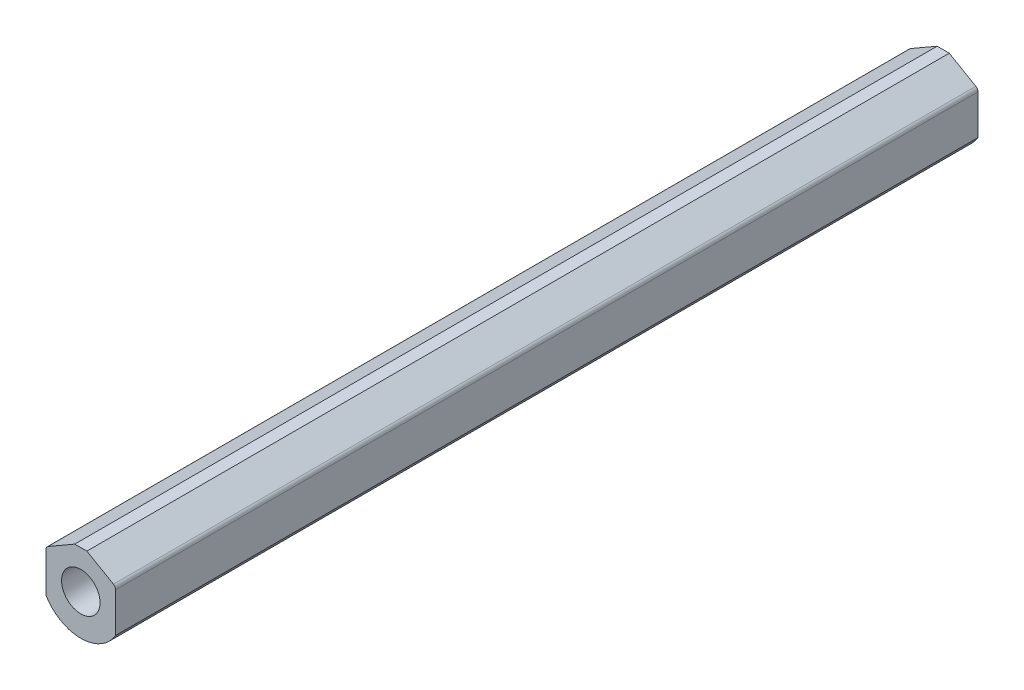
ISO-10303-21;
HEADER;
FILE_DESCRIPTION(('STEP AP214'),'2;1');
FILE_NAME('part.step','',(''),(''),'','','');
FILE_SCHEMA(('AUTOMOTIVE_DESIGN { 1 0 10303 214 1 1 1 1 }'));
ENDSEC;
DATA;
#1=APPLICATION_CONTEXT('core data for automotive mechanical design processes');
#2=APPLICATION_PROTOCOL_DEFINITION('international standard','automotive_design',2000,#1);
#3=PRODUCT_CONTEXT('',#1,'mechanical');
#4=PRODUCT('Part','Part','',(#3));
#5=PRODUCT_RELATED_PRODUCT_CATEGORY('part','',(#4));
#6=PRODUCT_DEFINITION_FORMATION('','',#4);
#7=PRODUCT_DEFINITION_CONTEXT('part definition',#1,'design');
#8=PRODUCT_DEFINITION('design','',#6,#7);
#9=PRODUCT_DEFINITION_SHAPE('','',#8);
#10=(LENGTH_UNIT() NAMED_UNIT(*) SI_UNIT(.MILLI.,.METRE.));
#11=(NAMED_UNIT(*) PLANE_ANGLE_UNIT() SI_UNIT($,.RADIAN.));
#12=(NAMED_UNIT(*) SI_UNIT($,.STERADIAN.) SOLID_ANGLE_UNIT());
#13=UNCERTAINTY_MEASURE_WITH_UNIT(LENGTH_MEASURE(1.E-05),#10,'distance_accuracy_value','');
#14=(GEOMETRIC_REPRESENTATION_CONTEXT(3) GLOBAL_UNCERTAINTY_ASSIGNED_CONTEXT((#13)) GLOBAL_UNIT_ASSIGNED_CONTEXT((#10,
#11,#12)) REPRESENTATION_CONTEXT('',''));
#15=CARTESIAN_POINT('',(0.,0.,0.));
#16=DIRECTION('',(0.,0.,1.));
#17=DIRECTION('',(1.,0.,0.));
#18=AXIS2_PLACEMENT_3D('',#15,#16,#17);
#19=CARTESIAN_POINT('',(-21.5519,13.4874,-609.6));
#20=DIRECTION('',(0.,0.,1.));
#21=DIRECTION('',(1.,0.,0.));
#22=AXIS2_PLACEMENT_3D('',#19,#20,#21);
#23=CYLINDRICAL_SURFACE('',#22,3.048);
#24=CARTESIAN_POINT('',(-21.5519,13.4874,0.));
#25=DIRECTION('',(0.,0.,1.));
#26=DIRECTION('',(1.,0.,0.));
#27=AXIS2_PLACEMENT_3D('',#24,#25,#26);
#28=CIRCLE('',#27,3.048);
#29=CARTESIAN_POINT('',(-23.0759,16.127045430735,0.));
#30=VERTEX_POINT('',#29);
#31=CARTESIAN_POINT('',(-24.5999,13.4874,0.));
#32=VERTEX_POINT('',#31);
#33=EDGE_CURVE('E130',#30,#32,#28,.T.);
#34=ORIENTED_EDGE('',*,*,#33,.F.);
#35=DIRECTION('',(0.,0.,1.));
#36=VECTOR('',#35,1.);
#37=CARTESIAN_POINT('',(-23.0759,16.127045430735,-609.6));
#38=LINE('',#37,#36);
#39=CARTESIAN_POINT('',(-23.0759,16.127045430735,-609.6));
#40=VERTEX_POINT('',#39);
#41=EDGE_CURVE('E11',#40,#30,#38,.T.);
#42=ORIENTED_EDGE('',*,*,#41,.F.);
#43=CARTESIAN_POINT('',(-21.5519,13.4874,-609.6));
#44=DIRECTION('',(0.,0.,1.));
#45=DIRECTION('',(1.,0.,0.));
#46=AXIS2_PLACEMENT_3D('',#43,#44,#45);
#47=CIRCLE('',#46,3.048);
#48=CARTESIAN_POINT('',(-24.5999,13.4874,-609.6));
#49=VERTEX_POINT('',#48);
#50=EDGE_CURVE('E151',#40,#49,#47,.T.);
#51=ORIENTED_EDGE('',*,*,#50,.T.);
#52=DIRECTION('',(0.,0.,1.));
#53=VECTOR('',#52,1.);
#54=CARTESIAN_POINT('',(-24.5999,13.4874,-609.6));
#55=LINE('',#54,#53);
#56=EDGE_CURVE('E36',#49,#32,#55,.T.);
#57=ORIENTED_EDGE('',*,*,#56,.T.);
#58=EDGE_LOOP('',(#34,#42,#51,#57));
#59=FACE_BOUND('',#58,.T.);
#60=ADVANCED_FACE('F33',(#59),#23,.T.);
#61=CARTESIAN_POINT('',(-4.28703793799527,26.9748,-609.6));
#62=DIRECTION('',(-0.499999999999995,0.866025403784442,0.));
#63=DIRECTION('',(-0.866025403784442,-0.499999999999995,0.));
#64=AXIS2_PLACEMENT_3D('',#61,#62,#63);
#65=PLANE('',#64);
#66=DIRECTION('',(-0.866025403784442,-0.499999999999995,0.));
#67=VECTOR('',#66,1.);
#68=CARTESIAN_POINT('',(-4.28703793799527,26.9748,0.));
#69=LINE('',#68,#67);
#70=CARTESIAN_POINT('',(-4.28703793799527,26.9748,0.));
#71=VERTEX_POINT('',#70);
#72=EDGE_CURVE('E149',#71,#30,#69,.T.);
#73=ORIENTED_EDGE('',*,*,#72,.F.);
#74=DIRECTION('',(0.,0.,1.));
#75=VECTOR('',#74,1.);
#76=CARTESIAN_POINT('',(-4.28703793799527,26.9748,-609.6));
#77=LINE('',#76,#75);
#78=CARTESIAN_POINT('',(-4.28703793799527,26.9748,-609.6));
#79=VERTEX_POINT('',#78);
#80=EDGE_CURVE('E42',#79,#71,#77,.T.);
#81=ORIENTED_EDGE('',*,*,#80,.F.);
#82=DIRECTION('',(-0.866025403784442,-0.499999999999995,0.));
#83=VECTOR('',#82,1.);
#84=CARTESIAN_POINT('',(-4.28703793799527,26.9748,-609.6));
#85=LINE('',#84,#83);
#86=EDGE_CURVE('E120',#79,#40,#85,.T.);
#87=ORIENTED_EDGE('',*,*,#86,.T.);
#88=ORIENTED_EDGE('',*,*,#41,.T.);
#89=EDGE_LOOP('',(#73,#81,#87,#88));
#90=FACE_BOUND('',#89,.T.);
#91=ADVANCED_FACE('F163',(#90),#65,.T.);
#92=CARTESIAN_POINT('',(-4.28703793799527,26.9748,-609.6));
#93=DIRECTION('',(0.,1.,0.));
#94=DIRECTION('',(0.,0.,1.));
#95=AXIS2_PLACEMENT_3D('',#92,#93,#94);
#96=PLANE('',#95);
#97=DIRECTION('',(-1.,0.,0.));
#98=VECTOR('',#97,1.);
#99=CARTESIAN_POINT('',(-4.28703793799527,26.9748,0.));
#100=LINE('',#99,#98);
#101=CARTESIAN_POINT('',(4.28703793799527,26.9748,0.));
#102=VERTEX_POINT('',#101);
#103=EDGE_CURVE('E107',#102,#71,#100,.T.);
#104=ORIENTED_EDGE('',*,*,#103,.F.);
#105=DIRECTION('',(0.,0.,1.));
#106=VECTOR('',#105,1.);
#107=CARTESIAN_POINT('',(4.28703793799527,26.9748,-609.6));
#108=LINE('',#107,#106);
#109=CARTESIAN_POINT('',(4.28703793799527,26.9748,-609.6));
#110=VERTEX_POINT('',#109);
#111=EDGE_CURVE('E102',#110,#102,#108,.T.);
#112=ORIENTED_EDGE('',*,*,#111,.F.);
#113=DIRECTION('',(-1.,0.,0.));
#114=VECTOR('',#113,1.);
#115=CARTESIAN_POINT('',(-4.28703793799527,26.9748,-609.6));
#116=LINE('',#115,#114);
#117=EDGE_CURVE('E105',#110,#79,#116,.T.);
#118=ORIENTED_EDGE('',*,*,#117,.T.);
#119=ORIENTED_EDGE('',*,*,#80,.T.);
#120=EDGE_LOOP('',(#104,#112,#118,#119));
#121=FACE_BOUND('',#120,.T.);
#122=ADVANCED_FACE('F104',(#121),#96,.T.);
#123=CARTESIAN_POINT('',(4.28703793799527,26.9748,-609.6));
#124=DIRECTION('',(0.499999999999995,0.866025403784442,0.));
#125=DIRECTION('',(-0.866025403784442,0.499999999999995,0.));
#126=AXIS2_PLACEMENT_3D('',#123,#124,#125);
#127=PLANE('',#126);
#128=DIRECTION('',(-0.866025403784441,0.499999999999995,0.));
#129=VECTOR('',#128,1.);
#130=CARTESIAN_POINT('',(4.28703793799527,26.9748,0.));
#131=LINE('',#130,#129);
#132=CARTESIAN_POINT('',(23.0759,16.127045430735,0.));
#133=VERTEX_POINT('',#132);
#134=EDGE_CURVE('E146',#133,#102,#131,.T.);
#135=ORIENTED_EDGE('',*,*,#134,.F.);
#136=DIRECTION('',(0.,0.,1.));
#137=VECTOR('',#136,1.);
#138=CARTESIAN_POINT('',(23.0759,16.127045430735,-609.6));
#139=LINE('',#138,#137);
#140=CARTESIAN_POINT('',(23.0759,16.127045430735,-609.6));
#141=VERTEX_POINT('',#140);
#142=EDGE_CURVE('E112',#141,#133,#139,.T.);
#143=ORIENTED_EDGE('',*,*,#142,.F.);
#144=DIRECTION('',(-0.866025403784441,0.499999999999995,0.));
#145=VECTOR('',#144,1.);
#146=CARTESIAN_POINT('',(4.28703793799527,26.9748,-609.6));
#147=LINE('',#146,#145);
#148=EDGE_CURVE('E118',#141,#110,#147,.T.);
#149=ORIENTED_EDGE('',*,*,#148,.T.);
#150=ORIENTED_EDGE('',*,*,#111,.T.);
#151=EDGE_LOOP('',(#135,#143,#149,#150));
#152=FACE_BOUND('',#151,.T.);
#153=ADVANCED_FACE('F122',(#152),#127,.T.);
#154=CARTESIAN_POINT('',(21.5519,13.4874,-609.6));
#155=DIRECTION('',(0.,0.,1.));
#156=DIRECTION('',(1.,0.,0.));
#157=AXIS2_PLACEMENT_3D('',#154,#155,#156);
#158=CYLINDRICAL_SURFACE('',#157,3.048);
#159=CARTESIAN_POINT('',(21.5519,13.4874,0.));
#160=DIRECTION('',(0.,0.,1.));
#161=DIRECTION('',(-1.,0.,0.));
#162=AXIS2_PLACEMENT_3D('',#159,#160,#161);
#163=CIRCLE('',#162,3.048);
#164=CARTESIAN_POINT('',(24.5999,13.4874,0.));
#165=VERTEX_POINT('',#164);
#166=EDGE_CURVE('E143',#165,#133,#163,.T.);
#167=ORIENTED_EDGE('',*,*,#166,.F.);
#168=DIRECTION('',(0.,0.,1.));
#169=VECTOR('',#168,1.);
#170=CARTESIAN_POINT('',(24.5999,13.4874,-609.6));
#171=LINE('',#170,#169);
#172=CARTESIAN_POINT('',(24.5999,13.4874,-609.6));
#173=VERTEX_POINT('',#172);
#174=EDGE_CURVE('E155',#173,#165,#171,.T.);
#175=ORIENTED_EDGE('',*,*,#174,.F.);
#176=CARTESIAN_POINT('',(21.5519,13.4874,-609.6));
#177=DIRECTION('',(0.,0.,1.));
#178=DIRECTION('',(-1.,0.,0.));
#179=AXIS2_PLACEMENT_3D('',#176,#177,#178);
#180=CIRCLE('',#179,3.048);
#181=EDGE_CURVE('E123',#173,#141,#180,.T.);
#182=ORIENTED_EDGE('',*,*,#181,.T.);
#183=ORIENTED_EDGE('',*,*,#142,.T.);
#184=EDGE_LOOP('',(#167,#175,#182,#183));
#185=FACE_BOUND('',#184,.T.);
#186=ADVANCED_FACE('F176',(#185),#158,.T.);
#187=CARTESIAN_POINT('',(24.5999,13.4874,-609.6));
#188=DIRECTION('',(1.,0.,0.));
#189=DIRECTION('',(0.,1.,0.));
#190=AXIS2_PLACEMENT_3D('',#187,#188,#189);
#191=PLANE('',#190);
#192=DIRECTION('',(0.,1.,0.));
#193=VECTOR('',#192,1.);
#194=CARTESIAN_POINT('',(24.5999,13.4874,0.));
#195=LINE('',#194,#193);
#196=CARTESIAN_POINT('',(24.5999,-14.5387600912182,0.));
#197=VERTEX_POINT('',#196);
#198=EDGE_CURVE('E140',#197,#165,#195,.T.);
#199=ORIENTED_EDGE('',*,*,#198,.F.);
#200=DIRECTION('',(0.,0.,1.));
#201=VECTOR('',#200,1.);
#202=CARTESIAN_POINT('',(24.5999,-14.5387600912182,-609.6));
#203=LINE('',#202,#201);
#204=CARTESIAN_POINT('',(24.5999,-14.5387600912182,-609.6));
#205=VERTEX_POINT('',#204);
#206=EDGE_CURVE('E157',#205,#197,#203,.T.);
#207=ORIENTED_EDGE('',*,*,#206,.F.);
#208=DIRECTION('',(0.,1.,0.));
#209=VECTOR('',#208,1.);
#210=CARTESIAN_POINT('',(24.5999,13.4874,-609.6));
#211=LINE('',#210,#209);
#212=EDGE_CURVE('E125',#205,#173,#211,.T.);
#213=ORIENTED_EDGE('',*,*,#212,.T.);
#214=ORIENTED_EDGE('',*,*,#174,.T.);
#215=EDGE_LOOP('',(#199,#207,#213,#214));
#216=FACE_BOUND('',#215,.T.);
#217=ADVANCED_FACE('F179',(#216),#191,.T.);
#218=CARTESIAN_POINT('',(0.,0.,-609.6));
#219=DIRECTION('',(0.,0.,1.));
#220=DIRECTION('',(1.,0.,0.));
#221=AXIS2_PLACEMENT_3D('',#218,#219,#220);
#222=CYLINDRICAL_SURFACE('',#221,28.575);
#223=CARTESIAN_POINT('',(0.,0.,0.));
#224=DIRECTION('',(0.,0.,1.));
#225=DIRECTION('',(1.,0.,0.));
#226=AXIS2_PLACEMENT_3D('',#223,#224,#225);
#227=CIRCLE('',#226,28.575);
#228=CARTESIAN_POINT('',(-24.5999,-14.5387600912182,0.));
#229=VERTEX_POINT('',#228);
#230=EDGE_CURVE('E137',#229,#197,#227,.T.);
#231=ORIENTED_EDGE('',*,*,#230,.F.);
#232=DIRECTION('',(0.,0.,1.));
#233=VECTOR('',#232,1.);
#234=CARTESIAN_POINT('',(-24.5999,-14.5387600912182,-609.6));
#235=LINE('',#234,#233);
#236=CARTESIAN_POINT('',(-24.5999,-14.5387600912182,-609.6));
#237=VERTEX_POINT('',#236);
#238=EDGE_CURVE('E158',#237,#229,#235,.T.);
#239=ORIENTED_EDGE('',*,*,#238,.F.);
#240=CARTESIAN_POINT('',(0.,0.,-609.6));
#241=DIRECTION('',(0.,0.,1.));
#242=DIRECTION('',(1.,0.,0.));
#243=AXIS2_PLACEMENT_3D('',#240,#241,#242);
#244=CIRCLE('',#243,28.575);
#245=EDGE_CURVE('E214',#237,#205,#244,.T.);
#246=ORIENTED_EDGE('',*,*,#245,.T.);
#247=ORIENTED_EDGE('',*,*,#206,.T.);
#248=EDGE_LOOP('',(#231,#239,#246,#247));
#249=FACE_BOUND('',#248,.T.);
#250=ADVANCED_FACE('F183',(#249),#222,.T.);
#251=CARTESIAN_POINT('',(-24.5999,13.4874,-609.6));
#252=DIRECTION('',(-1.,0.,0.));
#253=DIRECTION('',(0.,-1.,0.));
#254=AXIS2_PLACEMENT_3D('',#251,#252,#253);
#255=PLANE('',#254);
#256=DIRECTION('',(0.,-1.,0.));
#257=VECTOR('',#256,1.);
#258=CARTESIAN_POINT('',(-24.5999,13.4874,0.));
#259=LINE('',#258,#257);
#260=EDGE_CURVE('E133',#32,#229,#259,.T.);
#261=ORIENTED_EDGE('',*,*,#260,.F.);
#262=ORIENTED_EDGE('',*,*,#56,.F.);
#263=DIRECTION('',(0.,-1.,0.));
#264=VECTOR('',#263,1.);
#265=CARTESIAN_POINT('',(-24.5999,13.4874,-609.6));
#266=LINE('',#265,#264);
#267=EDGE_CURVE('E212',#49,#237,#266,.T.);
#268=ORIENTED_EDGE('',*,*,#267,.T.);
#269=ORIENTED_EDGE('',*,*,#238,.T.);
#270=EDGE_LOOP('',(#261,#262,#268,#269));
#271=FACE_BOUND('',#270,.T.);
#272=ADVANCED_FACE('F160',(#271),#255,.T.);
#273=CARTESIAN_POINT('',(-21.5519,13.4874,-609.6));
#274=DIRECTION('',(0.,0.,1.));
#275=DIRECTION('',(1.,0.,0.));
#276=AXIS2_PLACEMENT_3D('',#273,#274,#275);
#277=PLANE('',#276);
#278=CARTESIAN_POINT('',(0.,0.,-609.6));
#279=DIRECTION('',(0.,0.,1.));
#280=DIRECTION('',(1.,0.,0.));
#281=AXIS2_PLACEMENT_3D('',#278,#279,#280);
#282=CIRCLE('',#281,13.6144);
#283=CARTESIAN_POINT('',(13.6144,0.,-609.6));
#284=VERTEX_POINT('',#283);
#285=EDGE_CURVE('E134',#284,#284,#282,.T.);
#286=ORIENTED_EDGE('',*,*,#285,.T.);
#287=EDGE_LOOP('',(#286));
#288=FACE_BOUND('',#287,.T.);
#289=ORIENTED_EDGE('',*,*,#50,.F.);
#290=ORIENTED_EDGE('',*,*,#86,.F.);
#291=ORIENTED_EDGE('',*,*,#117,.F.);
#292=ORIENTED_EDGE('',*,*,#148,.F.);
#293=ORIENTED_EDGE('',*,*,#181,.F.);
#294=ORIENTED_EDGE('',*,*,#212,.F.);
#295=ORIENTED_EDGE('',*,*,#245,.F.);
#296=ORIENTED_EDGE('',*,*,#267,.F.);
#297=EDGE_LOOP('',(#289,#290,#291,#292,#293,#294,#295,#296));
#298=FACE_BOUND('',#297,.T.);
#299=ADVANCED_FACE('F116',(#288,#298),#277,.F.);
#300=CARTESIAN_POINT('',(-21.5519,13.4874,0.));
#301=DIRECTION('',(0.,0.,1.));
#302=DIRECTION('',(1.,0.,0.));
#303=AXIS2_PLACEMENT_3D('',#300,#301,#302);
#304=PLANE('',#303);
#305=CARTESIAN_POINT('',(0.,0.,0.));
#306=DIRECTION('',(0.,0.,1.));
#307=DIRECTION('',(1.,0.,0.));
#308=AXIS2_PLACEMENT_3D('',#305,#306,#307);
#309=CIRCLE('',#308,13.6144);
#310=CARTESIAN_POINT('',(13.6144,0.,0.));
#311=VERTEX_POINT('',#310);
#312=EDGE_CURVE('E207',#311,#311,#309,.T.);
#313=ORIENTED_EDGE('',*,*,#312,.F.);
#314=EDGE_LOOP('',(#313));
#315=FACE_BOUND('',#314,.T.);
#316=ORIENTED_EDGE('',*,*,#33,.T.);
#317=ORIENTED_EDGE('',*,*,#260,.T.);
#318=ORIENTED_EDGE('',*,*,#230,.T.);
#319=ORIENTED_EDGE('',*,*,#198,.T.);
#320=ORIENTED_EDGE('',*,*,#166,.T.);
#321=ORIENTED_EDGE('',*,*,#134,.T.);
#322=ORIENTED_EDGE('',*,*,#103,.T.);
#323=ORIENTED_EDGE('',*,*,#72,.T.);
#324=EDGE_LOOP('',(#316,#317,#318,#319,#320,#321,#322,#323));
#325=FACE_BOUND('',#324,.T.);
#326=ADVANCED_FACE('F162',(#315,#325),#304,.T.);
#327=CARTESIAN_POINT('',(0.,0.,-609.6));
#328=DIRECTION('',(0.,0.,1.));
#329=DIRECTION('',(1.,0.,0.));
#330=AXIS2_PLACEMENT_3D('',#327,#328,#329);
#331=CYLINDRICAL_SURFACE('',#330,13.6144);
#332=ORIENTED_EDGE('',*,*,#285,.F.);
#333=EDGE_LOOP('',(#332));
#334=FACE_BOUND('',#333,.T.);
#335=ORIENTED_EDGE('',*,*,#312,.T.);
#336=EDGE_LOOP('',(#335));
#337=FACE_BOUND('',#336,.T.);
#338=ADVANCED_FACE('F195',(#334,#337),#331,.F.);
#339=CLOSED_SHELL('',(#60,#91,#122,#153,#186,#217,#250,#272,#299,#326,#338));
#340=MANIFOLD_SOLID_BREP('B2',#339);
#341=ADVANCED_BREP_SHAPE_REPRESENTATION('',(#18,#340),#14);
#342=SHAPE_DEFINITION_REPRESENTATION(#9,#341);
ENDSEC;
END-ISO-10303-21;
